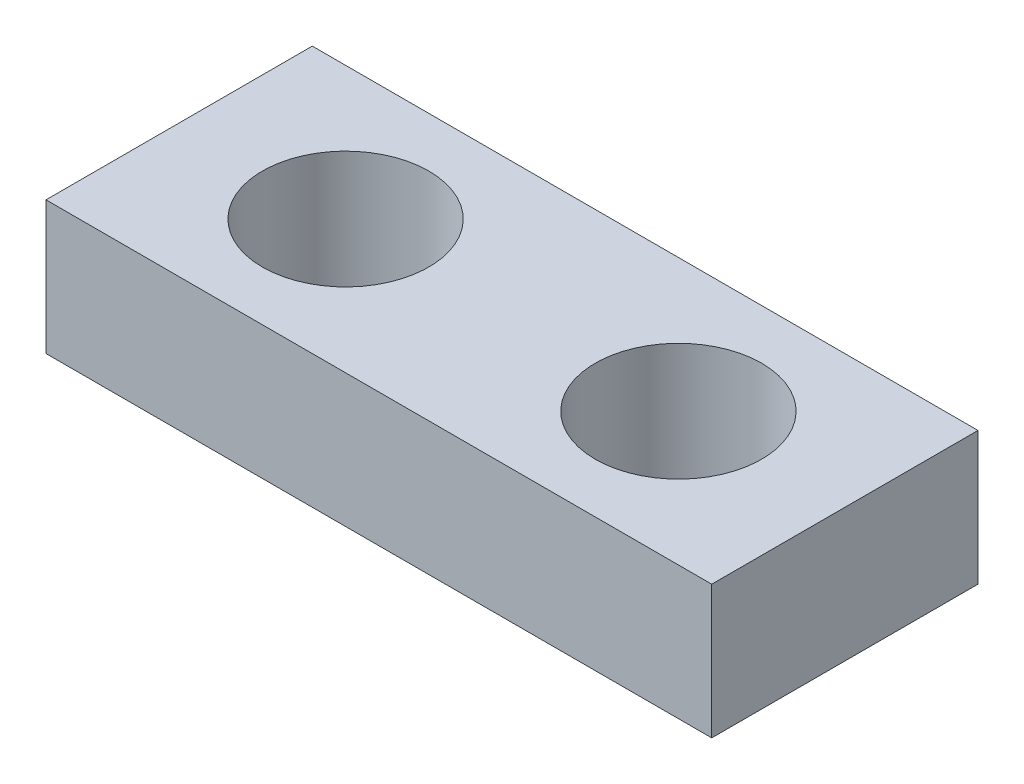
ISO-10303-21;
HEADER;
FILE_DESCRIPTION(('STEP AP214'),'2;1');
FILE_NAME('part.step','',(''),(''),'','','');
FILE_SCHEMA(('AUTOMOTIVE_DESIGN { 1 0 10303 214 1 1 1 1 }'));
ENDSEC;
DATA;
#1=APPLICATION_CONTEXT('core data for automotive mechanical design processes');
#2=APPLICATION_PROTOCOL_DEFINITION('international standard','automotive_design',2000,#1);
#3=PRODUCT_CONTEXT('',#1,'mechanical');
#4=PRODUCT('Part','Part','',(#3));
#5=PRODUCT_RELATED_PRODUCT_CATEGORY('part','',(#4));
#6=PRODUCT_DEFINITION_FORMATION('','',#4);
#7=PRODUCT_DEFINITION_CONTEXT('part definition',#1,'design');
#8=PRODUCT_DEFINITION('design','',#6,#7);
#9=PRODUCT_DEFINITION_SHAPE('','',#8);
#10=(LENGTH_UNIT() NAMED_UNIT(*) SI_UNIT(.MILLI.,.METRE.));
#11=(NAMED_UNIT(*) PLANE_ANGLE_UNIT() SI_UNIT($,.RADIAN.));
#12=(NAMED_UNIT(*) SI_UNIT($,.STERADIAN.) SOLID_ANGLE_UNIT());
#13=UNCERTAINTY_MEASURE_WITH_UNIT(LENGTH_MEASURE(1.E-05),#10,'distance_accuracy_value','');
#14=(GEOMETRIC_REPRESENTATION_CONTEXT(3) GLOBAL_UNCERTAINTY_ASSIGNED_CONTEXT((#13)) GLOBAL_UNIT_ASSIGNED_CONTEXT((#10,
#11,#12)) REPRESENTATION_CONTEXT('',''));
#15=CARTESIAN_POINT('',(0.,0.,0.));
#16=DIRECTION('',(0.,0.,1.));
#17=DIRECTION('',(1.,0.,0.));
#18=AXIS2_PLACEMENT_3D('',#15,#16,#17);
#19=CARTESIAN_POINT('',(0.,25.4,0.));
#20=DIRECTION('',(1.,0.,0.));
#21=DIRECTION('',(0.,0.,-1.));
#22=AXIS2_PLACEMENT_3D('',#19,#20,#21);
#23=PLANE('',#22);
#24=DIRECTION('',(0.,0.,1.));
#25=VECTOR('',#24,1.);
#26=CARTESIAN_POINT('',(0.,0.,0.));
#27=LINE('',#26,#25);
#28=CARTESIAN_POINT('',(0.,0.,-50.8));
#29=VERTEX_POINT('',#28);
#30=CARTESIAN_POINT('',(0.,0.,0.));
#31=VERTEX_POINT('',#30);
#32=EDGE_CURVE('E96',#29,#31,#27,.T.);
#33=ORIENTED_EDGE('',*,*,#32,.T.);
#34=DIRECTION('',(0.,-1.,0.));
#35=VECTOR('',#34,1.);
#36=CARTESIAN_POINT('',(0.,25.4,0.));
#37=LINE('',#36,#35);
#38=CARTESIAN_POINT('',(0.,25.4,0.));
#39=VERTEX_POINT('',#38);
#40=EDGE_CURVE('E11',#39,#31,#37,.T.);
#41=ORIENTED_EDGE('',*,*,#40,.F.);
#42=DIRECTION('',(0.,0.,1.));
#43=VECTOR('',#42,1.);
#44=CARTESIAN_POINT('',(0.,25.4,0.));
#45=LINE('',#44,#43);
#46=CARTESIAN_POINT('',(0.,25.4,-50.8));
#47=VERTEX_POINT('',#46);
#48=EDGE_CURVE('E84',#47,#39,#45,.T.);
#49=ORIENTED_EDGE('',*,*,#48,.F.);
#50=DIRECTION('',(0.,-1.,0.));
#51=VECTOR('',#50,1.);
#52=CARTESIAN_POINT('',(0.,25.4,-50.8));
#53=LINE('',#52,#51);
#54=EDGE_CURVE('E92',#47,#29,#53,.T.);
#55=ORIENTED_EDGE('',*,*,#54,.T.);
#56=EDGE_LOOP('',(#33,#41,#49,#55));
#57=FACE_BOUND('',#56,.T.);
#58=ADVANCED_FACE('F33',(#57),#23,.F.);
#59=CARTESIAN_POINT('',(0.,25.4,0.));
#60=DIRECTION('',(0.,0.,-1.));
#61=DIRECTION('',(-1.,0.,0.));
#62=AXIS2_PLACEMENT_3D('',#59,#60,#61);
#63=PLANE('',#62);
#64=DIRECTION('',(1.,0.,0.));
#65=VECTOR('',#64,1.);
#66=CARTESIAN_POINT('',(0.,0.,0.));
#67=LINE('',#66,#65);
#68=CARTESIAN_POINT('',(127.,0.,0.));
#69=VERTEX_POINT('',#68);
#70=EDGE_CURVE('E88',#31,#69,#67,.T.);
#71=ORIENTED_EDGE('',*,*,#70,.T.);
#72=DIRECTION('',(0.,-1.,0.));
#73=VECTOR('',#72,1.);
#74=CARTESIAN_POINT('',(127.,25.4,0.));
#75=LINE('',#74,#73);
#76=CARTESIAN_POINT('',(127.,25.4,0.));
#77=VERTEX_POINT('',#76);
#78=EDGE_CURVE('E41',#77,#69,#75,.T.);
#79=ORIENTED_EDGE('',*,*,#78,.F.);
#80=DIRECTION('',(1.,0.,0.));
#81=VECTOR('',#80,1.);
#82=CARTESIAN_POINT('',(0.,25.4,0.));
#83=LINE('',#82,#81);
#84=EDGE_CURVE('E79',#39,#77,#83,.T.);
#85=ORIENTED_EDGE('',*,*,#84,.F.);
#86=ORIENTED_EDGE('',*,*,#40,.T.);
#87=EDGE_LOOP('',(#71,#79,#85,#86));
#88=FACE_BOUND('',#87,.T.);
#89=ADVANCED_FACE('F87',(#88),#63,.F.);
#90=CARTESIAN_POINT('',(127.,25.4,0.));
#91=DIRECTION('',(-1.,0.,0.));
#92=DIRECTION('',(0.,0.,1.));
#93=AXIS2_PLACEMENT_3D('',#90,#91,#92);
#94=PLANE('',#93);
#95=DIRECTION('',(0.,0.,-1.));
#96=VECTOR('',#95,1.);
#97=CARTESIAN_POINT('',(127.,0.,0.));
#98=LINE('',#97,#96);
#99=CARTESIAN_POINT('',(127.,0.,-50.8));
#100=VERTEX_POINT('',#99);
#101=EDGE_CURVE('E66',#69,#100,#98,.T.);
#102=ORIENTED_EDGE('',*,*,#101,.T.);
#103=DIRECTION('',(0.,-1.,0.));
#104=VECTOR('',#103,1.);
#105=CARTESIAN_POINT('',(127.,25.4,-50.8));
#106=LINE('',#105,#104);
#107=CARTESIAN_POINT('',(127.,25.4,-50.8));
#108=VERTEX_POINT('',#107);
#109=EDGE_CURVE('E89',#108,#100,#106,.T.);
#110=ORIENTED_EDGE('',*,*,#109,.F.);
#111=DIRECTION('',(0.,0.,-1.));
#112=VECTOR('',#111,1.);
#113=CARTESIAN_POINT('',(127.,25.4,0.));
#114=LINE('',#113,#112);
#115=EDGE_CURVE('E82',#77,#108,#114,.T.);
#116=ORIENTED_EDGE('',*,*,#115,.F.);
#117=ORIENTED_EDGE('',*,*,#78,.T.);
#118=EDGE_LOOP('',(#102,#110,#116,#117));
#119=FACE_BOUND('',#118,.T.);
#120=ADVANCED_FACE('F90',(#119),#94,.F.);
#121=CARTESIAN_POINT('',(0.,25.4,-50.8));
#122=DIRECTION('',(0.,0.,1.));
#123=DIRECTION('',(1.,0.,0.));
#124=AXIS2_PLACEMENT_3D('',#121,#122,#123);
#125=PLANE('',#124);
#126=DIRECTION('',(-1.,0.,0.));
#127=VECTOR('',#126,1.);
#128=CARTESIAN_POINT('',(0.,0.,-50.8));
#129=LINE('',#128,#127);
#130=EDGE_CURVE('E72',#100,#29,#129,.T.);
#131=ORIENTED_EDGE('',*,*,#130,.T.);
#132=ORIENTED_EDGE('',*,*,#54,.F.);
#133=DIRECTION('',(-1.,0.,0.));
#134=VECTOR('',#133,1.);
#135=CARTESIAN_POINT('',(0.,25.4,-50.8));
#136=LINE('',#135,#134);
#137=EDGE_CURVE('E49',#108,#47,#136,.T.);
#138=ORIENTED_EDGE('',*,*,#137,.F.);
#139=ORIENTED_EDGE('',*,*,#109,.T.);
#140=EDGE_LOOP('',(#131,#132,#138,#139));
#141=FACE_BOUND('',#140,.T.);
#142=ADVANCED_FACE('F104',(#141),#125,.F.);
#143=CARTESIAN_POINT('',(0.,25.4,0.));
#144=DIRECTION('',(0.,-1.,0.));
#145=DIRECTION('',(0.,0.,-1.));
#146=AXIS2_PLACEMENT_3D('',#143,#144,#145);
#147=PLANE('',#146);
#148=CARTESIAN_POINT('',(95.25,25.4,-25.4));
#149=DIRECTION('',(0.,1.,0.));
#150=DIRECTION('',(0.,0.,1.));
#151=AXIS2_PLACEMENT_3D('',#148,#149,#150);
#152=CIRCLE('',#151,15.875);
#153=CARTESIAN_POINT('',(95.25,25.4,-9.525));
#154=VERTEX_POINT('',#153);
#155=EDGE_CURVE('E116',#154,#154,#152,.T.);
#156=ORIENTED_EDGE('',*,*,#155,.F.);
#157=EDGE_LOOP('',(#156));
#158=FACE_BOUND('',#157,.T.);
#159=CARTESIAN_POINT('',(31.75,25.4,-25.4));
#160=DIRECTION('',(0.,1.,0.));
#161=DIRECTION('',(0.,0.,1.));
#162=AXIS2_PLACEMENT_3D('',#159,#160,#161);
#163=CIRCLE('',#162,15.875);
#164=CARTESIAN_POINT('',(31.75,25.4,-9.525));
#165=VERTEX_POINT('',#164);
#166=EDGE_CURVE('E110',#165,#165,#163,.T.);
#167=ORIENTED_EDGE('',*,*,#166,.F.);
#168=EDGE_LOOP('',(#167));
#169=FACE_BOUND('',#168,.T.);
#170=ORIENTED_EDGE('',*,*,#48,.T.);
#171=ORIENTED_EDGE('',*,*,#84,.T.);
#172=ORIENTED_EDGE('',*,*,#115,.T.);
#173=ORIENTED_EDGE('',*,*,#137,.T.);
#174=EDGE_LOOP('',(#170,#171,#172,#173));
#175=FACE_BOUND('',#174,.T.);
#176=ADVANCED_FACE('F80',(#158,#169,#175),#147,.F.);
#177=CARTESIAN_POINT('',(0.,0.,0.));
#178=DIRECTION('',(0.,-1.,0.));
#179=DIRECTION('',(0.,0.,-1.));
#180=AXIS2_PLACEMENT_3D('',#177,#178,#179);
#181=PLANE('',#180);
#182=CARTESIAN_POINT('',(95.25,0.,-25.4));
#183=DIRECTION('',(0.,1.,0.));
#184=DIRECTION('',(0.,0.,1.));
#185=AXIS2_PLACEMENT_3D('',#182,#183,#184);
#186=CIRCLE('',#185,15.875);
#187=CARTESIAN_POINT('',(95.25,0.,-9.525));
#188=VERTEX_POINT('',#187);
#189=EDGE_CURVE('E113',#188,#188,#186,.T.);
#190=ORIENTED_EDGE('',*,*,#189,.T.);
#191=EDGE_LOOP('',(#190));
#192=FACE_BOUND('',#191,.T.);
#193=CARTESIAN_POINT('',(31.75,0.,-25.4));
#194=DIRECTION('',(0.,1.,0.));
#195=DIRECTION('',(0.,0.,1.));
#196=AXIS2_PLACEMENT_3D('',#193,#194,#195);
#197=CIRCLE('',#196,15.875);
#198=CARTESIAN_POINT('',(31.75,0.,-9.525));
#199=VERTEX_POINT('',#198);
#200=EDGE_CURVE('E99',#199,#199,#197,.T.);
#201=ORIENTED_EDGE('',*,*,#200,.T.);
#202=EDGE_LOOP('',(#201));
#203=FACE_BOUND('',#202,.T.);
#204=ORIENTED_EDGE('',*,*,#32,.F.);
#205=ORIENTED_EDGE('',*,*,#130,.F.);
#206=ORIENTED_EDGE('',*,*,#101,.F.);
#207=ORIENTED_EDGE('',*,*,#70,.F.);
#208=EDGE_LOOP('',(#204,#205,#206,#207));
#209=FACE_BOUND('',#208,.T.);
#210=ADVANCED_FACE('F107',(#192,#203,#209),#181,.T.);
#211=CARTESIAN_POINT('',(31.75,0.,-25.4));
#212=DIRECTION('',(0.,1.,0.));
#213=DIRECTION('',(0.,0.,1.));
#214=AXIS2_PLACEMENT_3D('',#211,#212,#213);
#215=CYLINDRICAL_SURFACE('',#214,15.875);
#216=ORIENTED_EDGE('',*,*,#200,.F.);
#217=EDGE_LOOP('',(#216));
#218=FACE_BOUND('',#217,.T.);
#219=ORIENTED_EDGE('',*,*,#166,.T.);
#220=EDGE_LOOP('',(#219));
#221=FACE_BOUND('',#220,.T.);
#222=ADVANCED_FACE('F127',(#218,#221),#215,.F.);
#223=CARTESIAN_POINT('',(95.25,0.,-25.4));
#224=DIRECTION('',(0.,1.,0.));
#225=DIRECTION('',(0.,0.,1.));
#226=AXIS2_PLACEMENT_3D('',#223,#224,#225);
#227=CYLINDRICAL_SURFACE('',#226,15.875);
#228=ORIENTED_EDGE('',*,*,#189,.F.);
#229=EDGE_LOOP('',(#228));
#230=FACE_BOUND('',#229,.T.);
#231=ORIENTED_EDGE('',*,*,#155,.T.);
#232=EDGE_LOOP('',(#231));
#233=FACE_BOUND('',#232,.T.);
#234=ADVANCED_FACE('F124',(#230,#233),#227,.F.);
#235=CLOSED_SHELL('',(#58,#89,#120,#142,#176,#210,#222,#234));
#236=MANIFOLD_SOLID_BREP('B2',#235);
#237=ADVANCED_BREP_SHAPE_REPRESENTATION('',(#18,#236),#14);
#238=SHAPE_DEFINITION_REPRESENTATION(#9,#237);
ENDSEC;
END-ISO-10303-21;
